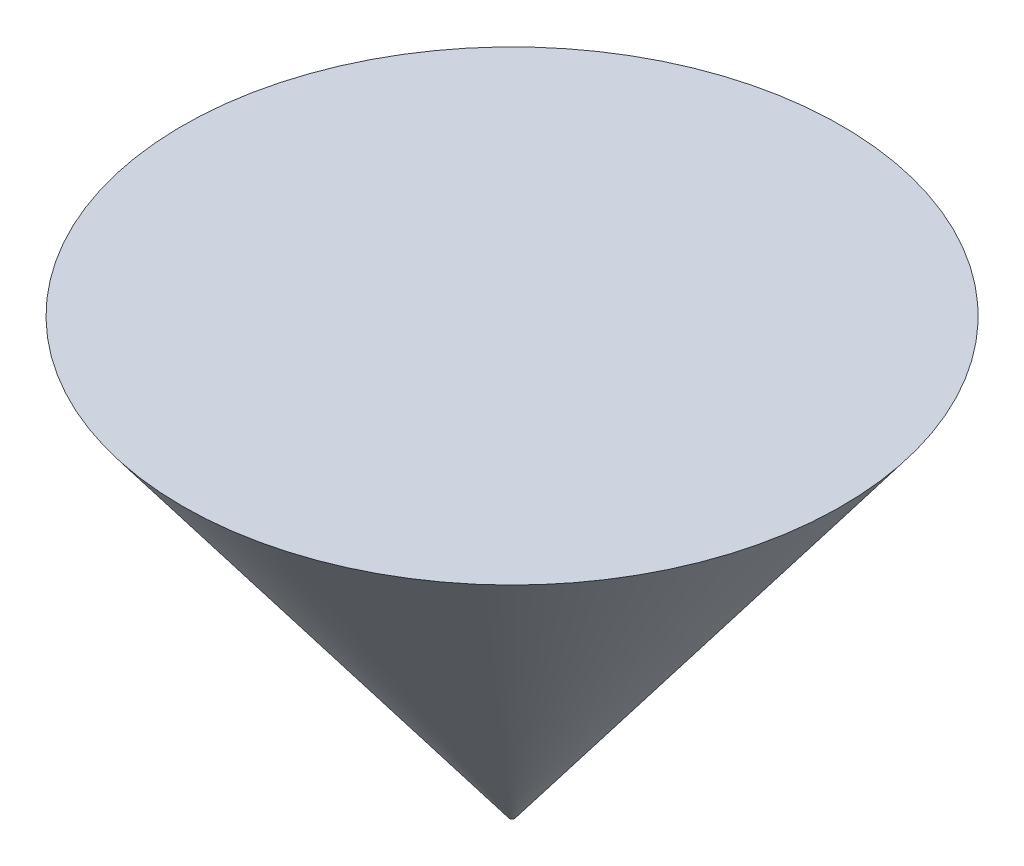
ISO-10303-21;
HEADER;
FILE_DESCRIPTION(('STEP AP214'),'2;1');
FILE_NAME('part.step','',(''),(''),'','','');
FILE_SCHEMA(('AUTOMOTIVE_DESIGN { 1 0 10303 214 1 1 1 1 }'));
ENDSEC;
DATA;
#1=APPLICATION_CONTEXT('core data for automotive mechanical design processes');
#2=APPLICATION_PROTOCOL_DEFINITION('international standard','automotive_design',2000,#1);
#3=PRODUCT_CONTEXT('',#1,'mechanical');
#4=PRODUCT('Part','Part','',(#3));
#5=PRODUCT_RELATED_PRODUCT_CATEGORY('part','',(#4));
#6=PRODUCT_DEFINITION_FORMATION('','',#4);
#7=PRODUCT_DEFINITION_CONTEXT('part definition',#1,'design');
#8=PRODUCT_DEFINITION('design','',#6,#7);
#9=PRODUCT_DEFINITION_SHAPE('','',#8);
#10=(LENGTH_UNIT() NAMED_UNIT(*) SI_UNIT(.MILLI.,.METRE.));
#11=(NAMED_UNIT(*) PLANE_ANGLE_UNIT() SI_UNIT($,.RADIAN.));
#12=(NAMED_UNIT(*) SI_UNIT($,.STERADIAN.) SOLID_ANGLE_UNIT());
#13=UNCERTAINTY_MEASURE_WITH_UNIT(LENGTH_MEASURE(1.E-05),#10,'distance_accuracy_value','');
#14=(GEOMETRIC_REPRESENTATION_CONTEXT(3) GLOBAL_UNCERTAINTY_ASSIGNED_CONTEXT((#13)) GLOBAL_UNIT_ASSIGNED_CONTEXT((#10,
#11,#12)) REPRESENTATION_CONTEXT('',''));
#15=CARTESIAN_POINT('',(0.,0.,0.));
#16=DIRECTION('',(0.,0.,1.));
#17=DIRECTION('',(1.,0.,0.));
#18=AXIS2_PLACEMENT_3D('',#15,#16,#17);
#19=CARTESIAN_POINT('',(0.,0.,0.));
#20=DIRECTION('',(0.,1.,0.));
#21=DIRECTION('',(0.,0.,1.));
#22=AXIS2_PLACEMENT_3D('',#19,#20,#21);
#23=CONICAL_SURFACE('',#22,12.7,0.645771823237902);
#24=CARTESIAN_POINT('',(0.,2000.,0.));
#25=DIRECTION('',(0.,1.,0.));
#26=DIRECTION('',(0.,0.,1.));
#27=AXIS2_PLACEMENT_3D('',#24,#25,#26);
#28=CIRCLE('',#27,1519.80810020559);
#29=CARTESIAN_POINT('',(0.,2000.,1519.80810020559));
#30=VERTEX_POINT('',#29);
#31=EDGE_CURVE('E10',#30,#30,#28,.T.);
#32=ORIENTED_EDGE('',*,*,#31,.F.);
#33=EDGE_LOOP('',(#32));
#34=FACE_BOUND('',#33,.T.);
#35=CARTESIAN_POINT('',(0.,0.,0.));
#36=DIRECTION('',(0.,1.,0.));
#37=DIRECTION('',(0.,0.,1.));
#38=AXIS2_PLACEMENT_3D('',#35,#36,#37);
#39=CIRCLE('',#38,12.7);
#40=CARTESIAN_POINT('',(0.,0.,12.7));
#41=VERTEX_POINT('',#40);
#42=EDGE_CURVE('E38',#41,#41,#39,.T.);
#43=ORIENTED_EDGE('',*,*,#42,.T.);
#44=EDGE_LOOP('',(#43));
#45=FACE_BOUND('',#44,.T.);
#46=ADVANCED_FACE('F32',(#34,#45),#23,.T.);
#47=CARTESIAN_POINT('',(0.,2000.,0.));
#48=DIRECTION('',(0.,1.,0.));
#49=DIRECTION('',(0.,0.,1.));
#50=AXIS2_PLACEMENT_3D('',#47,#48,#49);
#51=PLANE('',#50);
#52=ORIENTED_EDGE('',*,*,#31,.T.);
#53=EDGE_LOOP('',(#52));
#54=FACE_BOUND('',#53,.T.);
#55=ADVANCED_FACE('F47',(#54),#51,.T.);
#56=CARTESIAN_POINT('',(0.,0.,0.));
#57=DIRECTION('',(0.,1.,0.));
#58=DIRECTION('',(0.,0.,1.));
#59=AXIS2_PLACEMENT_3D('',#56,#57,#58);
#60=PLANE('',#59);
#61=ORIENTED_EDGE('',*,*,#42,.F.);
#62=EDGE_LOOP('',(#61));
#63=FACE_BOUND('',#62,.T.);
#64=ADVANCED_FACE('F45',(#63),#60,.F.);
#65=CLOSED_SHELL('',(#46,#55,#64));
#66=MANIFOLD_SOLID_BREP('B2',#65);
#67=ADVANCED_BREP_SHAPE_REPRESENTATION('',(#18,#66),#14);
#68=SHAPE_DEFINITION_REPRESENTATION(#9,#67);
ENDSEC;
END-ISO-10303-21;
